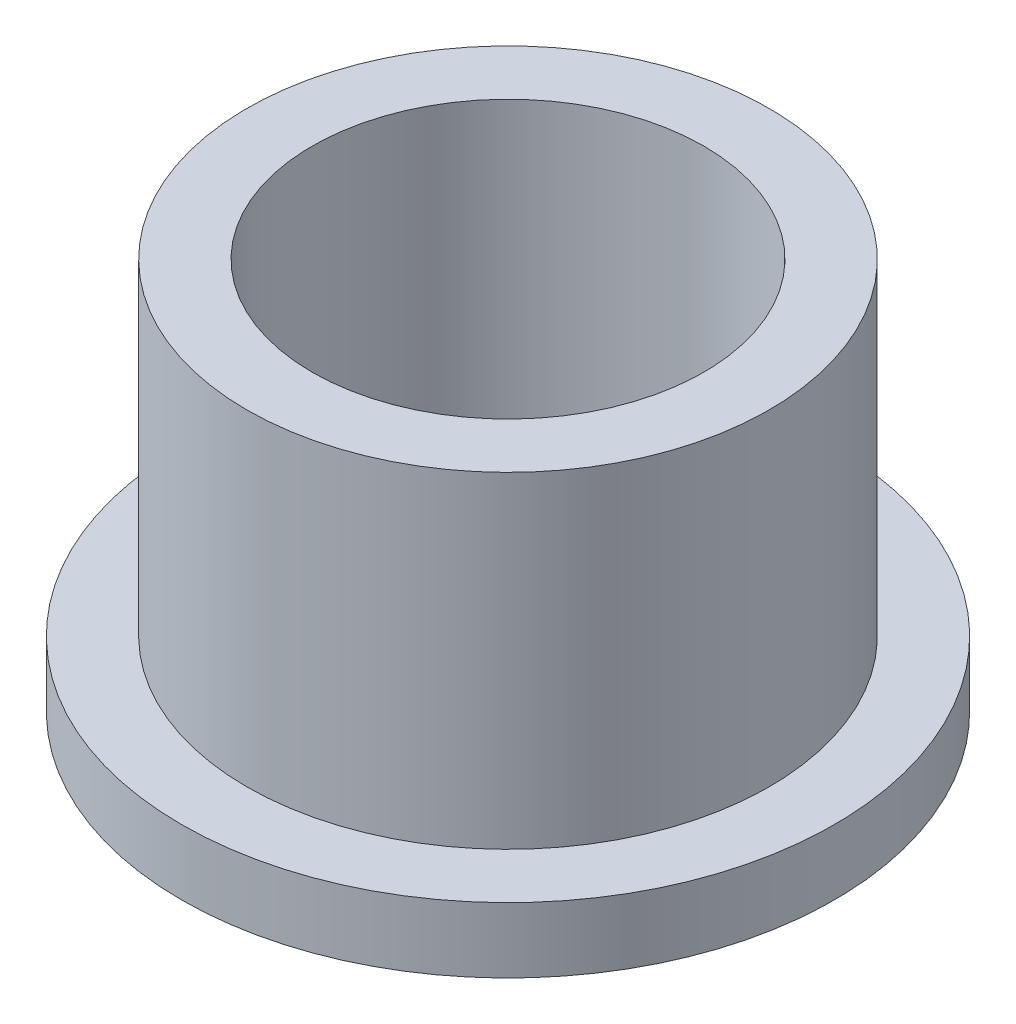
ISO-10303-21;
HEADER;
FILE_DESCRIPTION(('STEP AP214'),'2;1');
FILE_NAME('part.step','',(''),(''),'','','');
FILE_SCHEMA(('AUTOMOTIVE_DESIGN { 1 0 10303 214 1 1 1 1 }'));
ENDSEC;
DATA;
#1=APPLICATION_CONTEXT('core data for automotive mechanical design processes');
#2=APPLICATION_PROTOCOL_DEFINITION('international standard','automotive_design',2000,#1);
#3=PRODUCT_CONTEXT('',#1,'mechanical');
#4=PRODUCT('Part','Part','',(#3));
#5=PRODUCT_RELATED_PRODUCT_CATEGORY('part','',(#4));
#6=PRODUCT_DEFINITION_FORMATION('','',#4);
#7=PRODUCT_DEFINITION_CONTEXT('part definition',#1,'design');
#8=PRODUCT_DEFINITION('design','',#6,#7);
#9=PRODUCT_DEFINITION_SHAPE('','',#8);
#10=(LENGTH_UNIT() NAMED_UNIT(*) SI_UNIT(.MILLI.,.METRE.));
#11=(NAMED_UNIT(*) PLANE_ANGLE_UNIT() SI_UNIT($,.RADIAN.));
#12=(NAMED_UNIT(*) SI_UNIT($,.STERADIAN.) SOLID_ANGLE_UNIT());
#13=UNCERTAINTY_MEASURE_WITH_UNIT(LENGTH_MEASURE(1.E-05),#10,'distance_accuracy_value','');
#14=(GEOMETRIC_REPRESENTATION_CONTEXT(3) GLOBAL_UNCERTAINTY_ASSIGNED_CONTEXT((#13)) GLOBAL_UNIT_ASSIGNED_CONTEXT((#10,
#11,#12)) REPRESENTATION_CONTEXT('',''));
#15=CARTESIAN_POINT('',(0.,0.,0.));
#16=DIRECTION('',(0.,0.,1.));
#17=DIRECTION('',(1.,0.,0.));
#18=AXIS2_PLACEMENT_3D('',#15,#16,#17);
#19=CARTESIAN_POINT('',(0.,9.525,0.));
#20=DIRECTION('',(0.,1.,0.));
#21=DIRECTION('',(0.,0.,1.));
#22=AXIS2_PLACEMENT_3D('',#19,#20,#21);
#23=PLANE('',#22);
#24=CARTESIAN_POINT('',(0.,9.525,0.));
#25=DIRECTION('',(0.,1.,0.));
#26=DIRECTION('',(0.,0.,1.));
#27=AXIS2_PLACEMENT_3D('',#24,#25,#26);
#28=CIRCLE('',#27,6.35);
#29=CARTESIAN_POINT('',(0.,9.525,6.35));
#30=VERTEX_POINT('',#29);
#31=EDGE_CURVE('E10',#30,#30,#28,.T.);
#32=ORIENTED_EDGE('',*,*,#31,.T.);
#33=EDGE_LOOP('',(#32));
#34=FACE_BOUND('',#33,.T.);
#35=CARTESIAN_POINT('',(0.,9.525,0.));
#36=DIRECTION('',(0.,1.,0.));
#37=DIRECTION('',(0.,0.,1.));
#38=AXIS2_PLACEMENT_3D('',#35,#36,#37);
#39=CIRCLE('',#38,4.7625);
#40=CARTESIAN_POINT('',(0.,9.525,4.7625));
#41=VERTEX_POINT('',#40);
#42=EDGE_CURVE('E55',#41,#41,#39,.F.);
#43=ORIENTED_EDGE('',*,*,#42,.T.);
#44=EDGE_LOOP('',(#43));
#45=FACE_BOUND('',#44,.T.);
#46=ADVANCED_FACE('F35',(#34,#45),#23,.T.);
#47=CARTESIAN_POINT('',(0.,0.,0.));
#48=DIRECTION('',(0.,1.,0.));
#49=DIRECTION('',(0.,0.,1.));
#50=AXIS2_PLACEMENT_3D('',#47,#48,#49);
#51=PLANE('',#50);
#52=CARTESIAN_POINT('',(0.,0.,0.));
#53=DIRECTION('',(0.,1.,0.));
#54=DIRECTION('',(0.,0.,1.));
#55=AXIS2_PLACEMENT_3D('',#52,#53,#54);
#56=CIRCLE('',#55,7.9375);
#57=CARTESIAN_POINT('',(0.,0.,7.9375));
#58=VERTEX_POINT('',#57);
#59=EDGE_CURVE('E51',#58,#58,#56,.T.);
#60=ORIENTED_EDGE('',*,*,#59,.F.);
#61=EDGE_LOOP('',(#60));
#62=FACE_BOUND('',#61,.T.);
#63=CARTESIAN_POINT('',(0.,0.,0.));
#64=DIRECTION('',(0.,1.,0.));
#65=DIRECTION('',(0.,0.,1.));
#66=AXIS2_PLACEMENT_3D('',#63,#64,#65);
#67=CIRCLE('',#66,4.7625);
#68=CARTESIAN_POINT('',(0.,0.,4.7625));
#69=VERTEX_POINT('',#68);
#70=EDGE_CURVE('E61',#69,#69,#67,.T.);
#71=ORIENTED_EDGE('',*,*,#70,.T.);
#72=EDGE_LOOP('',(#71));
#73=FACE_BOUND('',#72,.T.);
#74=ADVANCED_FACE('F66',(#62,#73),#51,.F.);
#75=CARTESIAN_POINT('',(0.,9.525,0.));
#76=DIRECTION('',(0.,-1.,0.));
#77=DIRECTION('',(0.,0.,-1.));
#78=AXIS2_PLACEMENT_3D('',#75,#76,#77);
#79=CYLINDRICAL_SURFACE('',#78,6.35);
#80=CARTESIAN_POINT('',(0.,1.5875,0.));
#81=DIRECTION('',(0.,1.,0.));
#82=DIRECTION('',(0.,0.,1.));
#83=AXIS2_PLACEMENT_3D('',#80,#81,#82);
#84=CIRCLE('',#83,6.35);
#85=CARTESIAN_POINT('',(0.,1.5875,6.35));
#86=VERTEX_POINT('',#85);
#87=EDGE_CURVE('E39',#86,#86,#84,.T.);
#88=ORIENTED_EDGE('',*,*,#87,.T.);
#89=EDGE_LOOP('',(#88));
#90=FACE_BOUND('',#89,.T.);
#91=ORIENTED_EDGE('',*,*,#31,.F.);
#92=EDGE_LOOP('',(#91));
#93=FACE_BOUND('',#92,.T.);
#94=ADVANCED_FACE('F37',(#90,#93),#79,.T.);
#95=CARTESIAN_POINT('',(0.,1.5875,0.));
#96=DIRECTION('',(0.,1.,0.));
#97=DIRECTION('',(0.,0.,1.));
#98=AXIS2_PLACEMENT_3D('',#95,#96,#97);
#99=PLANE('',#98);
#100=CARTESIAN_POINT('',(0.,1.5875,0.));
#101=DIRECTION('',(0.,1.,0.));
#102=DIRECTION('',(0.,0.,1.));
#103=AXIS2_PLACEMENT_3D('',#100,#101,#102);
#104=CIRCLE('',#103,7.9375);
#105=CARTESIAN_POINT('',(0.,1.5875,7.9375));
#106=VERTEX_POINT('',#105);
#107=EDGE_CURVE('E49',#106,#106,#104,.T.);
#108=ORIENTED_EDGE('',*,*,#107,.T.);
#109=EDGE_LOOP('',(#108));
#110=FACE_BOUND('',#109,.T.);
#111=ORIENTED_EDGE('',*,*,#87,.F.);
#112=EDGE_LOOP('',(#111));
#113=FACE_BOUND('',#112,.T.);
#114=ADVANCED_FACE('F76',(#110,#113),#99,.T.);
#115=CARTESIAN_POINT('',(0.,1.5875,0.));
#116=DIRECTION('',(0.,-1.,0.));
#117=DIRECTION('',(0.,0.,-1.));
#118=AXIS2_PLACEMENT_3D('',#115,#116,#117);
#119=CYLINDRICAL_SURFACE('',#118,7.9375);
#120=ORIENTED_EDGE('',*,*,#107,.F.);
#121=EDGE_LOOP('',(#120));
#122=FACE_BOUND('',#121,.T.);
#123=ORIENTED_EDGE('',*,*,#59,.T.);
#124=EDGE_LOOP('',(#123));
#125=FACE_BOUND('',#124,.T.);
#126=ADVANCED_FACE('F70',(#122,#125),#119,.T.);
#127=CARTESIAN_POINT('',(0.,9.5875,0.));
#128=DIRECTION('',(0.,-1.,0.));
#129=DIRECTION('',(0.,0.,-1.));
#130=AXIS2_PLACEMENT_3D('',#127,#128,#129);
#131=CYLINDRICAL_SURFACE('',#130,4.7625);
#132=ORIENTED_EDGE('',*,*,#42,.F.);
#133=EDGE_LOOP('',(#132));
#134=FACE_BOUND('',#133,.T.);
#135=ORIENTED_EDGE('',*,*,#70,.F.);
#136=EDGE_LOOP('',(#135));
#137=FACE_BOUND('',#136,.T.);
#138=ADVANCED_FACE('F68',(#134,#137),#131,.F.);
#139=CLOSED_SHELL('',(#46,#74,#94,#114,#126,#138));
#140=MANIFOLD_SOLID_BREP('B2',#139);
#141=ADVANCED_BREP_SHAPE_REPRESENTATION('',(#18,#140),#14);
#142=SHAPE_DEFINITION_REPRESENTATION(#9,#141);
ENDSEC;
END-ISO-10303-21;
